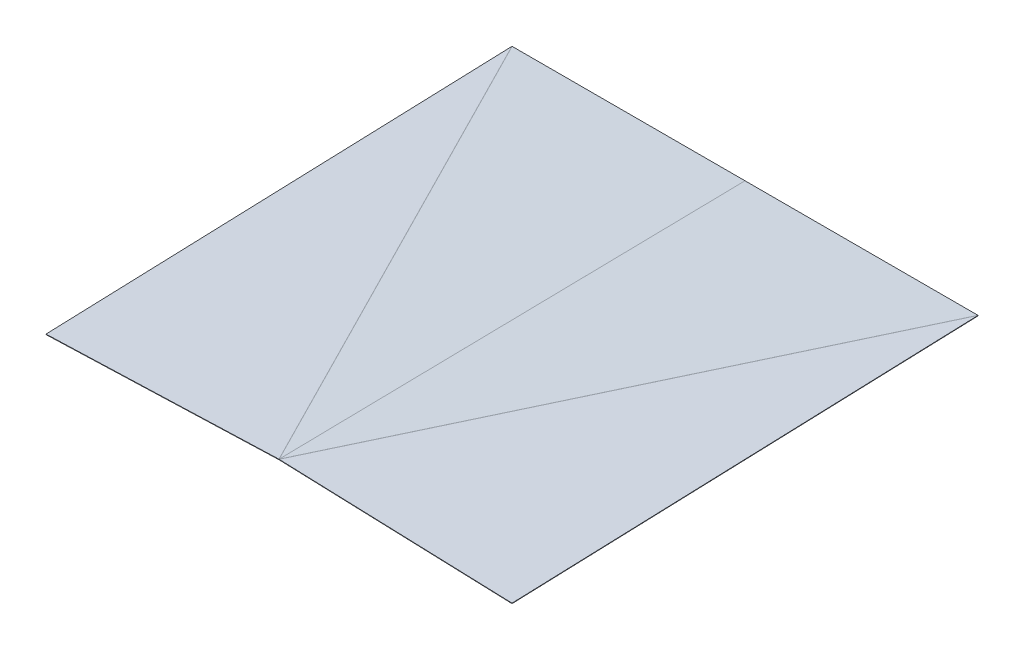
ISO-10303-21;
HEADER;
FILE_DESCRIPTION(('STEP AP214'),'2;1');
FILE_NAME('part.step','',(''),(''),'','','');
FILE_SCHEMA(('AUTOMOTIVE_DESIGN { 1 0 10303 214 1 1 1 1 }'));
ENDSEC;
DATA;
#1=APPLICATION_CONTEXT('core data for automotive mechanical design processes');
#2=APPLICATION_PROTOCOL_DEFINITION('international standard','automotive_design',2000,#1);
#3=PRODUCT_CONTEXT('',#1,'mechanical');
#4=PRODUCT('Part','Part','',(#3));
#5=PRODUCT_RELATED_PRODUCT_CATEGORY('part','',(#4));
#6=PRODUCT_DEFINITION_FORMATION('','',#4);
#7=PRODUCT_DEFINITION_CONTEXT('part definition',#1,'design');
#8=PRODUCT_DEFINITION('design','',#6,#7);
#9=PRODUCT_DEFINITION_SHAPE('','',#8);
#10=(LENGTH_UNIT() NAMED_UNIT(*) SI_UNIT(.MILLI.,.METRE.));
#11=(NAMED_UNIT(*) PLANE_ANGLE_UNIT() SI_UNIT($,.RADIAN.));
#12=(NAMED_UNIT(*) SI_UNIT($,.STERADIAN.) SOLID_ANGLE_UNIT());
#13=UNCERTAINTY_MEASURE_WITH_UNIT(LENGTH_MEASURE(1.E-05),#10,'distance_accuracy_value','');
#14=(GEOMETRIC_REPRESENTATION_CONTEXT(3) GLOBAL_UNCERTAINTY_ASSIGNED_CONTEXT((#13)) GLOBAL_UNIT_ASSIGNED_CONTEXT((#10,
#11,#12)) REPRESENTATION_CONTEXT('',''));
#15=CARTESIAN_POINT('',(0.,0.,0.));
#16=DIRECTION('',(0.,0.,1.));
#17=DIRECTION('',(1.,0.,0.));
#18=AXIS2_PLACEMENT_3D('',#15,#16,#17);
#19=CARTESIAN_POINT('',(0.,26.1825973923264,-1500.));
#20=DIRECTION('',(3.04601948530253E-06,0.0174524059057338,-0.99984769516103));
#21=DIRECTION('',(0.999999984769129,-0.000174532924306342,0.));
#22=AXIS2_PLACEMENT_3D('',#19,#20,#21);
#23=PLANE('',#22);
#24=DIRECTION('',(0.00017450634209741,0.999847679932479,0.0174524061715492));
#25=VECTOR('',#24,1.);
#26=CARTESIAN_POINT('',(749.783031723872,26.0517355652113,-1500.));
#27=LINE('',#26,#25);
#28=CARTESIAN_POINT('',(749.783031723872,26.0517355652113,-1500.));
#29=VERTEX_POINT('',#28);
#30=CARTESIAN_POINT('',(749.783293483385,27.55150708511,-1499.97382139074));
#31=VERTEX_POINT('',#30);
#32=EDGE_CURVE('E11',#29,#31,#27,.T.);
#33=ORIENTED_EDGE('',*,*,#32,.F.);
#34=DIRECTION('',(0.999999984769129,-0.000174532924306342,0.));
#35=VECTOR('',#34,1.);
#36=CARTESIAN_POINT('',(0.,26.1825973923264,-1500.));
#37=LINE('',#36,#35);
#38=CARTESIAN_POINT('',(0.00174506341600313,26.1825970877554,-1500.));
#39=VERTEX_POINT('',#38);
#40=EDGE_CURVE('E273',#39,#29,#37,.T.);
#41=ORIENTED_EDGE('',*,*,#40,.F.);
#42=DIRECTION('',(0.00017450634209741,0.999847679932478,0.0174524061715697));
#43=VECTOR('',#42,1.);
#44=CARTESIAN_POINT('',(0.00174506341600313,26.1825970877554,-1500.));
#45=LINE('',#44,#43);
#46=CARTESIAN_POINT('',(0.00200682292914925,27.6823686076542,-1499.97382139074));
#47=VERTEX_POINT('',#46);
#48=EDGE_CURVE('E54',#39,#47,#45,.T.);
#49=ORIENTED_EDGE('',*,*,#48,.T.);
#50=DIRECTION('',(0.999999984769129,-0.000174532924306342,0.));
#51=VECTOR('',#50,1.);
#52=CARTESIAN_POINT('',(0.000261759513146116,27.6823689122252,-1499.97382139074));
#53=LINE('',#52,#51);
#54=EDGE_CURVE('E208',#47,#31,#53,.T.);
#55=ORIENTED_EDGE('',*,*,#54,.T.);
#56=EDGE_LOOP('',(#33,#41,#49,#55));
#57=FACE_BOUND('',#56,.T.);
#58=ADVANCED_FACE('F41',(#57),#23,.T.);
#59=CARTESIAN_POINT('',(-4.97096941732543E-12,27.6823687827755,-1499.97382139034));
#60=CARTESIAN_POINT('',(-4.97096944158867E-12,27.1824449351973,-1499.98254759356));
#61=CARTESIAN_POINT('',(-4.97096946585192E-12,26.6825210876191,-1499.99127379678));
#62=CARTESIAN_POINT('',(-4.97096949011516E-12,26.1825972400409,-1500.));
#63=CARTESIAN_POINT('',(-23.000000000005,27.6823687827755,-1499.97382139034));
#64=CARTESIAN_POINT('',(-22.000000000005,27.1824449351973,-1499.98254759356));
#65=CARTESIAN_POINT('',(-21.000000000005,26.6825210876191,-1499.99127379678));
#66=CARTESIAN_POINT('',(-20.000000000005,26.1825972400409,-1500.));
#67=CARTESIAN_POINT('',(-23.000000000005,4.67977913642818,-1500.02617860966));
#68=CARTESIAN_POINT('',(-22.000000000005,5.17970298400638,-1500.01745240644));
#69=CARTESIAN_POINT('',(-21.000000000005,5.67962683158458,-1500.00872620322));
#70=CARTESIAN_POINT('',(-20.000000000005,6.17955067916277,-1500.));
#71=CARTESIAN_POINT('',(-4.96956218991128E-12,4.67977913642819,-1500.02617860966));
#72=CARTESIAN_POINT('',(-4.969623397988E-12,5.17970298400638,-1500.01745240644));
#73=CARTESIAN_POINT('',(-4.96968460606471E-12,5.67962683158458,-1500.00872620322));
#74=CARTESIAN_POINT('',(-4.96974581414143E-12,6.17955067916277,-1500.));
#75=CARTESIAN_POINT('',(22.999999999995,4.67977913642819,-1500.02617860966));
#76=CARTESIAN_POINT('',(21.999999999995,5.17970298400639,-1500.01745240644));
#77=CARTESIAN_POINT('',(20.999999999995,5.67962683158458,-1500.00872620322));
#78=CARTESIAN_POINT('',(19.999999999995,6.17955067916278,-1500.));
#79=CARTESIAN_POINT('',(22.999999999995,27.6823687827755,-1499.97382139034));
#80=CARTESIAN_POINT('',(21.999999999995,27.1824449351973,-1499.98254759356));
#81=CARTESIAN_POINT('',(20.999999999995,26.6825210876191,-1499.99127379678));
#82=CARTESIAN_POINT('',(19.999999999995,26.1825972400409,-1500.));
#83=CARTESIAN_POINT('',(-4.97096941732543E-12,27.6823687827755,-1499.97382139034));
#84=CARTESIAN_POINT('',(-4.97096944158867E-12,27.1824449351973,-1499.98254759356));
#85=CARTESIAN_POINT('',(-4.97096946585192E-12,26.6825210876191,-1499.99127379678));
#86=CARTESIAN_POINT('',(-4.97096949011516E-12,26.1825972400409,-1500.));
#87=(BOUNDED_SURFACE() B_SPLINE_SURFACE(3,3,((#59,#60,#61,#62),(#63,#64,#65,#66),(#67,#68,#69,
#70),(#71,#72,#73,#74),(#75,#76,#77,#78),(#79,#80,#81,#82),(#83,#84,#85,#86)),.UNSPECIFIED.,.T.,
.F.,.F.) B_SPLINE_SURFACE_WITH_KNOTS((4,3,4),(4,4),(0.,0.5,1.),(0.,1.),
.UNSPECIFIED.) GEOMETRIC_REPRESENTATION_ITEM() RATIONAL_B_SPLINE_SURFACE(((1.,1.,1.,1.),
(0.333333333333333,0.333333333333333,0.333333333333333,0.333333333333333),(0.333333333333333,
0.333333333333333,0.333333333333333,0.333333333333333),(1.,1.,1.,1.),(0.333333333333333,
0.333333333333333,0.333333333333333,0.333333333333333),(0.333333333333333,0.333333333333333,
0.333333333333333,0.333333333333333),(1.,1.,1.,1.))) REPRESENTATION_ITEM('') SURFACE());
#88=CARTESIAN_POINT('',(-4.97096997552787E-12,16.1810739596019,-1500.));
#89=DIRECTION('',(0.,0.,-1.));
#90=DIRECTION('',(0.,1.,0.));
#91=AXIS2_PLACEMENT_3D('',#88,#89,#90);
#92=ELLIPSE('',#91,10.0015232804391,10.);
#93=CARTESIAN_POINT('',(-0.00174506342609515,26.1825970877554,-1500.));
#94=VERTEX_POINT('',#93);
#95=EDGE_CURVE('E339',#39,#94,#92,.F.);
#96=DIRECTION('',(-0.00017450634209741,0.999847679932478,0.0174524061715492));
#97=VECTOR('',#96,1.);
#98=CARTESIAN_POINT('',(-0.00174506342609515,26.1825970877554,-1500.));
#99=LINE('',#98,#97);
#100=CARTESIAN_POINT('',(-0.00200682293926641,27.6823686076542,-1499.97382139074));
#101=VERTEX_POINT('',#100);
#102=EDGE_CURVE('E392',#94,#101,#99,.T.);
#103=CARTESIAN_POINT('',(-4.97096997552787E-12,16.1810739596019,-1500.));
#104=DIRECTION('',(0.,0.00227613866483323,-0.999997409593034));
#105=DIRECTION('',(0.,0.999997409593034,0.00227613866483323));
#106=AXIS2_PLACEMENT_3D('',#103,#104,#105);
#107=ELLIPSE('',#106,11.5013246162851,11.5);
#108=EDGE_CURVE('E235',#47,#101,#107,.F.);
#109=ORIENTED_EDGE('',*,*,#48,.F.);
#110=ORIENTED_EDGE('',*,*,#95,.T.);
#111=ORIENTED_EDGE('',*,*,#102,.T.);
#112=ORIENTED_EDGE('',*,*,#108,.F.);
#113=EDGE_LOOP('',(#109,#110,#111,#112));
#114=FACE_BOUND('',#113,.T.);
#115=ADVANCED_FACE('F411',(#114),#87,.F.);
#116=CARTESIAN_POINT('',(-750.,26.051697697103,-1500.));
#117=DIRECTION('',(-3.04601948530253E-06,0.0174524059057338,-0.99984769516103));
#118=DIRECTION('',(0.999999984769129,0.000174532924306342,0.));
#119=AXIS2_PLACEMENT_3D('',#116,#117,#118);
#120=PLANE('',#119);
#121=ORIENTED_EDGE('',*,*,#102,.F.);
#122=DIRECTION('',(0.999999984769129,0.000174532924306342,0.));
#123=VECTOR('',#122,1.);
#124=CARTESIAN_POINT('',(-750.,26.051697697103,-1500.));
#125=LINE('',#124,#123);
#126=CARTESIAN_POINT('',(-749.783031723872,26.0517355652113,-1500.));
#127=VERTEX_POINT('',#126);
#128=EDGE_CURVE('E281',#127,#94,#125,.T.);
#129=ORIENTED_EDGE('',*,*,#128,.F.);
#130=DIRECTION('',(-0.000174506342076608,0.999847679932478,0.0174524061715697));
#131=VECTOR('',#130,1.);
#132=CARTESIAN_POINT('',(-749.783031723872,26.0517355652113,-1500.));
#133=LINE('',#132,#131);
#134=CARTESIAN_POINT('',(-749.783293483385,27.55150708511,-1499.97382139074));
#135=VERTEX_POINT('',#134);
#136=EDGE_CURVE('E62',#127,#135,#133,.T.);
#137=ORIENTED_EDGE('',*,*,#136,.T.);
#138=DIRECTION('',(0.999999984769129,0.000174532924306342,0.));
#139=VECTOR('',#138,1.);
#140=CARTESIAN_POINT('',(-750.000261759513,27.5514692170017,-1499.97382139074));
#141=LINE('',#140,#139);
#142=EDGE_CURVE('E214',#135,#101,#141,.T.);
#143=ORIENTED_EDGE('',*,*,#142,.T.);
#144=EDGE_LOOP('',(#121,#129,#137,#143));
#145=FACE_BOUND('',#144,.T.);
#146=ADVANCED_FACE('F470',(#145),#120,.T.);
#147=CARTESIAN_POINT('',(-173.83730322874,-13.9475840839653,-348.638158916869));
#148=CARTESIAN_POINT('',(-173.833743905642,-14.4474619585485,-348.648620356601));
#149=CARTESIAN_POINT('',(-173.830184582543,-14.9473398331317,-348.659081796333));
#150=CARTESIAN_POINT('',(-173.826625259445,-15.4472177077149,-348.669543236065));
#151=CARTESIAN_POINT('',(-155.948786513254,-13.6331398838134,-357.576956071116));
#152=CARTESIAN_POINT('',(-155.050801354381,-14.117295548389,-358.03435736856));
#153=CARTESIAN_POINT('',(-154.152816195509,-14.6014512129646,-358.491758666004));
#154=CARTESIAN_POINT('',(-153.254831036636,-15.0856068775402,-358.949159963448));
#155=CARTESIAN_POINT('',(-731.972634035824,26.3655618803218,-1508.9214476791));
#156=CARTESIAN_POINT('',(-731.081767523148,26.8811619649126,-1509.35792609709));
#157=CARTESIAN_POINT('',(-730.190901010472,27.3967620495034,-1509.79440451507));
#158=CARTESIAN_POINT('',(-729.300034497796,27.9123621340942,-1510.23088293305));
#159=CARTESIAN_POINT('',(-749.86115075131,26.0511176801699,-1499.98265052486));
#160=CARTESIAN_POINT('',(-749.864710074408,26.5509955547531,-1499.97218908513));
#161=CARTESIAN_POINT('',(-749.868269397507,27.0508734293363,-1499.96172764539));
#162=CARTESIAN_POINT('',(-749.871828720605,27.5507513039195,-1499.95126620566));
#163=CARTESIAN_POINT('',(-767.749667466796,25.736673480018,-1491.04385337061));
#164=CARTESIAN_POINT('',(-768.647652625669,26.2208291445936,-1490.58645207317));
#165=CARTESIAN_POINT('',(-769.545637784542,26.7049848091692,-1490.12905077572));
#166=CARTESIAN_POINT('',(-770.443622943414,27.1891404737448,-1489.67164947828));
#167=CARTESIAN_POINT('',(-191.725819944226,-14.2620282841173,-339.699361762623));
#168=CARTESIAN_POINT('',(-192.616686456902,-14.7776283687081,-339.262883344643));
#169=CARTESIAN_POINT('',(-193.507552969578,-15.2932284532989,-338.826404926662));
#170=CARTESIAN_POINT('',(-194.398419482254,-15.8088285378897,-338.389926508682));
#171=CARTESIAN_POINT('',(-173.83730322874,-13.9475840839653,-348.638158916869));
#172=CARTESIAN_POINT('',(-173.833743905642,-14.4474619585485,-348.648620356601));
#173=CARTESIAN_POINT('',(-173.830184582543,-14.9473398331317,-348.659081796333));
#174=CARTESIAN_POINT('',(-173.826625259445,-15.4472177077149,-348.669543236065));
#175=(BOUNDED_SURFACE() B_SPLINE_SURFACE(3,3,((#147,#148,#149,#150),(#151,#152,#153,#154),(#155,
#156,#157,#158),(#159,#160,#161,#162),(#163,#164,#165,#166),(#167,#168,#169,#170),(#171,#172,
#173,#174)),.UNSPECIFIED.,.T.,.F.,.F.) B_SPLINE_SURFACE_WITH_KNOTS((4,3,4),(4,4),(0.,0.5,1.),
(0.,1.),.UNSPECIFIED.) GEOMETRIC_REPRESENTATION_ITEM() RATIONAL_B_SPLINE_SURFACE(((1.,1.,1.,1.),
(0.333333333333333,0.333333333333333,0.333333333333333,0.333333333333333),(0.333333333333333,
0.333333333333333,0.333333333333333,0.333333333333333),(1.,1.,1.,1.),(0.333333333333333,
0.333333333333333,0.333333333333333,0.333333333333333),(0.333333333333333,0.333333333333333,
0.333333333333333,0.333333333333333),(1.,1.,1.,1.))) REPRESENTATION_ITEM('') SURFACE());
#176=CARTESIAN_POINT('',(-461.849226990025,6.05176679810228,-924.310404720864));
#177=DIRECTION('',(-0.00017442716609027,0.99939403483228,0.0348070785447252));
#178=DIRECTION('',(0.447216271925113,-0.0310543918654342,0.893886587253255));
#179=AXIS2_PLACEMENT_3D('',#176,#177,#178);
#180=ELLIPSE('',#179,644.010385671997,10.);
#181=CARTESIAN_POINT('',(-750.,26.0366005234634,-1499.56652422699));
#182=VERTEX_POINT('',#181);
#183=EDGE_CURVE('E352',#127,#182,#180,.T.);
#184=DIRECTION('',(-0.034878375087267,0.998785983095707,0.0347859012074423));
#185=VECTOR('',#184,1.);
#186=CARTESIAN_POINT('',(-750.,26.0366005234634,-1499.56652422699));
#187=LINE('',#186,#185);
#188=CARTESIAN_POINT('',(-750.052317562631,27.5347794981069,-1499.51434537518));
#189=VERTEX_POINT('',#188);
#190=EDGE_CURVE('E132',#182,#189,#187,.T.);
#191=CARTESIAN_POINT('',(-461.849226990025,6.05176679810228,-924.310404720864));
#192=DIRECTION('',(0.000867043243752945,0.999319005895459,0.0368886526200803));
#193=DIRECTION('',(0.447215465447525,-0.0333816801342968,0.893803105217231));
#194=AXIS2_PLACEMENT_3D('',#191,#192,#193);
#195=ELLIPSE('',#194,644.035423601369,11.5);
#196=EDGE_CURVE('E243',#135,#189,#195,.T.);
#197=ORIENTED_EDGE('',*,*,#136,.F.);
#198=ORIENTED_EDGE('',*,*,#183,.T.);
#199=ORIENTED_EDGE('',*,*,#190,.T.);
#200=ORIENTED_EDGE('',*,*,#196,.F.);
#201=EDGE_LOOP('',(#197,#198,#199,#200));
#202=FACE_BOUND('',#201,.T.);
#203=ADVANCED_FACE('F501',(#202),#175,.T.);
#204=CARTESIAN_POINT('',(-750.,26.051697697103,-1500.));
#205=DIRECTION('',(-0.999391564378683,-0.0348572405371204,-0.00121401435964298));
#206=DIRECTION('',(0.,-0.034807079074225,0.999394050035481));
#207=AXIS2_PLACEMENT_3D('',#204,#205,#206);
#208=PLANE('',#207);
#209=ORIENTED_EDGE('',*,*,#190,.F.);
#210=DIRECTION('',(0.,-0.034807079074225,0.999394050035481));
#211=VECTOR('',#210,1.);
#212=CARTESIAN_POINT('',(-750.,26.051697697103,-1500.));
#213=LINE('',#212,#211);
#214=CARTESIAN_POINT('',(-750.,-26.1905771188057,0.));
#215=VERTEX_POINT('',#214);
#216=EDGE_CURVE('E286',#182,#215,#213,.T.);
#217=ORIENTED_EDGE('',*,*,#216,.T.);
#218=DIRECTION('',(-0.034878375087267,0.998785983095707,0.0347859012074423));
#219=VECTOR('',#218,1.);
#220=CARTESIAN_POINT('',(-750.,-26.1905771188057,0.));
#221=LINE('',#220,#219);
#222=CARTESIAN_POINT('',(-750.052317562631,-24.6923981441621,0.0521788518111635));
#223=VERTEX_POINT('',#222);
#224=EDGE_CURVE('E141',#215,#223,#221,.T.);
#225=ORIENTED_EDGE('',*,*,#224,.T.);
#226=DIRECTION('',(0.,-0.034807079074225,0.999394050035481));
#227=VECTOR('',#226,1.);
#228=CARTESIAN_POINT('',(-750.052317562631,27.5498766717465,-1499.94782114819));
#229=LINE('',#228,#227);
#230=EDGE_CURVE('E254',#189,#223,#229,.T.);
#231=ORIENTED_EDGE('',*,*,#230,.F.);
#232=EDGE_LOOP('',(#209,#217,#225,#231));
#233=FACE_BOUND('',#232,.T.);
#234=ADVANCED_FACE('F506',(#233),#208,.T.);
#235=CARTESIAN_POINT('',(-750.,-26.1905771188057,0.));
#236=DIRECTION('',(0.00121401044448242,-0.0347647105763103,0.999394787397446));
#237=DIRECTION('',(0.999390827019096,0.0348994967024942,0.));
#238=AXIS2_PLACEMENT_3D('',#235,#236,#237);
#239=PLANE('',#238);
#240=ORIENTED_EDGE('',*,*,#224,.F.);
#241=DIRECTION('',(0.999390827019096,0.0348994967024942,0.));
#242=VECTOR('',#241,1.);
#243=CARTESIAN_POINT('',(-750.,-26.1905771188057,0.));
#244=LINE('',#243,#242);
#245=CARTESIAN_POINT('',(-0.499695413509548,-0.0174497483512402,0.));
#246=VERTEX_POINT('',#245);
#247=EDGE_CURVE('E285',#215,#246,#244,.T.);
#248=ORIENTED_EDGE('',*,*,#247,.T.);
#249=DIRECTION('',(-0.034878375087267,0.998785983095707,0.0347859012074423));
#250=VECTOR('',#249,1.);
#251=CARTESIAN_POINT('',(-0.499695413509548,-0.0174497483512402,0.));
#252=LINE('',#251,#250);
#253=CARTESIAN_POINT('',(-0.552012976140449,1.48072922629232,0.0521788518111635));
#254=VERTEX_POINT('',#253);
#255=EDGE_CURVE('E383',#246,#254,#252,.T.);
#256=ORIENTED_EDGE('',*,*,#255,.T.);
#257=DIRECTION('',(-0.999390827019096,-0.0348994967024942,0.));
#258=VECTOR('',#257,1.);
#259=CARTESIAN_POINT('',(-0.0523175626309008,1.49817897464357,0.0521788518111635));
#260=LINE('',#259,#258);
#261=EDGE_CURVE('E250',#223,#254,#260,.F.);
#262=ORIENTED_EDGE('',*,*,#261,.F.);
#263=EDGE_LOOP('',(#240,#248,#256,#262));
#264=FACE_BOUND('',#263,.T.);
#265=ADVANCED_FACE('F514',(#264),#239,.T.);
#266=CARTESIAN_POINT('',(0.,0.,0.));
#267=DIRECTION('',(-0.034878375087267,0.998785983095707,0.0347859012074423));
#268=DIRECTION('',(-0.999390827019096,-0.0348994967024942,0.));
#269=AXIS2_PLACEMENT_3D('',#266,#267,#268);
#270=CYLINDRICAL_SURFACE('',#269,0.5);
#271=ORIENTED_EDGE('',*,*,#255,.F.);
#272=CARTESIAN_POINT('',(0.,0.,0.));
#273=DIRECTION('',(-0.034878375087267,0.998785983095707,0.0347859012074423));
#274=DIRECTION('',(-0.999390827019096,-0.0348994967024942,0.));
#275=AXIS2_PLACEMENT_3D('',#272,#273,#274);
#276=CIRCLE('',#275,0.5);
#277=CARTESIAN_POINT('',(-0.379504881327545,-0.00191484504903678,-0.325533989649321));
#278=VERTEX_POINT('',#277);
#279=EDGE_CURVE('E277',#278,#246,#276,.T.);
#280=ORIENTED_EDGE('',*,*,#279,.F.);
#281=DIRECTION('',(-0.034878375087267,0.998785983095707,0.0347859012074423));
#282=VECTOR('',#281,1.);
#283=CARTESIAN_POINT('',(-0.379504881327545,-0.00191484504903678,-0.325533989649321));
#284=LINE('',#283,#282);
#285=CARTESIAN_POINT('',(-0.431822443958446,1.49626412959452,-0.273355137838157));
#286=VERTEX_POINT('',#285);
#287=EDGE_CURVE('E380',#278,#286,#284,.T.);
#288=ORIENTED_EDGE('',*,*,#287,.T.);
#289=CARTESIAN_POINT('',(-0.0523175626309008,1.49817897464357,0.0521788518111637));
#290=DIRECTION('',(-0.034878375087267,0.998785983095707,0.0347859012074423));
#291=DIRECTION('',(-0.999390827019096,-0.0348994967024942,0.));
#292=AXIS2_PLACEMENT_3D('',#289,#290,#291);
#293=CIRCLE('',#292,0.5);
#294=EDGE_CURVE('E203',#286,#254,#293,.T.);
#295=ORIENTED_EDGE('',*,*,#294,.T.);
#296=EDGE_LOOP('',(#271,#280,#288,#295));
#297=FACE_BOUND('',#296,.T.);
#298=ADVANCED_FACE('F517',(#297),#270,.F.);
#299=CARTESIAN_POINT('',(-0.173453334640116,-0.00907216852146533,0.0865691037255389));
#300=DIRECTION('',(-0.893773880674253,-0.0467472550031436,0.446075043433453));
#301=DIRECTION('',(0.4471596461844,-0.015532357232986,0.894319292368799));
#302=AXIS2_PLACEMENT_3D('',#299,#300,#301);
#303=PLANE('',#302);
#304=ORIENTED_EDGE('',*,*,#287,.F.);
#305=DIRECTION('',(0.4471596461844,-0.015532357232986,0.894319292368799));
#306=VECTOR('',#305,1.);
#307=CARTESIAN_POINT('',(-0.173453334640116,-0.00907216852146533,0.0865691037255389));
#308=LINE('',#307,#306);
#309=CARTESIAN_POINT('',(-0.835411701997753,0.01392135051116,-1.23734763098974));
#310=VERTEX_POINT('',#309);
#311=EDGE_CURVE('E298',#310,#278,#308,.T.);
#312=ORIENTED_EDGE('',*,*,#311,.F.);
#313=DIRECTION('',(-0.034878375087252,0.998785983095708,0.0347859012074348));
#314=VECTOR('',#313,1.);
#315=CARTESIAN_POINT('',(-0.835411701997753,0.01392135051116,-1.23734763098974));
#316=LINE('',#315,#314);
#317=CARTESIAN_POINT('',(-0.887729264628654,1.51210032515472,-1.18516877917857));
#318=VERTEX_POINT('',#317);
#319=EDGE_CURVE('E377',#310,#318,#316,.T.);
#320=ORIENTED_EDGE('',*,*,#319,.T.);
#321=DIRECTION('',(0.4471596461844,-0.015532357232986,0.894319292368799));
#322=VECTOR('',#321,1.);
#323=CARTESIAN_POINT('',(-0.225770897271016,1.48910680612209,0.138747955536702));
#324=LINE('',#323,#322);
#325=EDGE_CURVE('E202',#318,#286,#324,.T.);
#326=ORIENTED_EDGE('',*,*,#325,.T.);
#327=EDGE_LOOP('',(#304,#312,#320,#326));
#328=FACE_BOUND('',#327,.T.);
#329=ADVANCED_FACE('F521',(#328),#303,.F.);
#330=CARTESIAN_POINT('',(-0.48662795112521,-9.97393848044592,-1.58520664306404));
#331=DIRECTION('',(-0.447159646184399,0.0155323572329809,-0.894319292368799));
#332=DIRECTION('',(-0.894427190999916,0.,0.447213595499958));
#333=AXIS2_PLACEMENT_3D('',#330,#331,#332);
#334=PLANE('',#333);
#335=ORIENTED_EDGE('',*,*,#319,.F.);
#336=CARTESIAN_POINT('',(-0.48662795112521,-9.97393848044592,-1.58520664306404));
#337=DIRECTION('',(0.447159646184399,-0.0155323572329809,0.894319292368799));
#338=DIRECTION('',(0.894427190999916,0.,-0.447213595499958));
#339=AXIS2_PLACEMENT_3D('',#336,#337,#338);
#340=CIRCLE('',#339,10.);
#341=CARTESIAN_POINT('',(-0.488374759609465,0.0245383113857771,-1.41068216951868));
#342=VERTEX_POINT('',#341);
#343=EDGE_CURVE('E343',#310,#342,#340,.F.);
#344=ORIENTED_EDGE('',*,*,#343,.T.);
#345=DIRECTION('',(-0.00017450634209741,0.999847679932478,0.0174524061715492));
#346=VECTOR('',#345,1.);
#347=CARTESIAN_POINT('',(-0.488374759609465,0.0245383113857771,-1.41068216951868));
#348=LINE('',#347,#346);
#349=CARTESIAN_POINT('',(-0.488636753254472,1.52430982920069,-1.38450344323161));
#350=VERTEX_POINT('',#349);
#351=EDGE_CURVE('E374',#342,#350,#348,.T.);
#352=ORIENTED_EDGE('',*,*,#351,.T.);
#353=CARTESIAN_POINT('',(-0.486627951125233,-9.97393848044592,-1.58520664306408));
#354=DIRECTION('',(0.4471596461844,-0.015532357232986,0.894319292368799));
#355=DIRECTION('',(0.894427190999916,0.,-0.447213595499958));
#356=AXIS2_PLACEMENT_3D('',#353,#354,#355);
#357=CIRCLE('',#356,11.5);
#358=EDGE_CURVE('E239',#318,#350,#357,.F.);
#359=ORIENTED_EDGE('',*,*,#358,.F.);
#360=EDGE_LOOP('',(#335,#344,#352,#359));
#361=FACE_BOUND('',#360,.T.);
#362=ADVANCED_FACE('F525',(#361),#334,.F.);
#363=CARTESIAN_POINT('',(-0.341220743643984,0.0251701728555556,-1.44541009812566));
#364=DIRECTION('',(0.229723569280202,-0.0169455757174329,0.973108385114818));
#365=DIRECTION('',(-0.973255902250123,-0.00417904262300681,0.229685620660185));
#366=AXIS2_PLACEMENT_3D('',#363,#364,#365);
#367=PLANE('',#366);
#368=ORIENTED_EDGE('',*,*,#351,.F.);
#369=DIRECTION('',(-0.973255902250123,-0.00417904262300681,0.229685620660185));
#370=VECTOR('',#369,1.);
#371=CARTESIAN_POINT('',(-0.341220743643984,0.0251701728555556,-1.44541009812566));
#372=LINE('',#371,#370);
#373=CARTESIAN_POINT('',(-0.00174680848440324,0.0266278398858926,-1.52552539168408));
#374=VERTEX_POINT('',#373);
#375=EDGE_CURVE('E302',#374,#342,#372,.T.);
#376=ORIENTED_EDGE('',*,*,#375,.F.);
#377=DIRECTION('',(-0.000174680847943225,0.999847679902015,0.0174524061710175));
#378=VECTOR('',#377,1.);
#379=CARTESIAN_POINT('',(-0.00174680848440324,0.0266278398858926,-1.52552539168408));
#380=LINE('',#379,#378);
#381=CARTESIAN_POINT('',(-0.00200856799754936,1.52639935978461,-1.49934678242676));
#382=VERTEX_POINT('',#381);
#383=EDGE_CURVE('E371',#374,#382,#380,.T.);
#384=ORIENTED_EDGE('',*,*,#383,.T.);
#385=DIRECTION('',(-0.973255902250123,-0.00417904262300681,0.229685620660185));
#386=VECTOR('',#385,1.);
#387=CARTESIAN_POINT('',(-0.34148250315713,1.52494169275427,-1.41923148886834));
#388=LINE('',#387,#386);
#389=EDGE_CURVE('E231',#382,#350,#388,.T.);
#390=ORIENTED_EDGE('',*,*,#389,.T.);
#391=EDGE_LOOP('',(#368,#376,#384,#390));
#392=FACE_BOUND('',#391,.T.);
#393=ADVANCED_FACE('F529',(#392),#367,.T.);
#394=CARTESIAN_POINT('',(-4.97097124483063E-12,-9.97184895904473,-1.70004945853251));
#395=DIRECTION('',(1.24206532456251E-13,0.0174524069511086,-0.999847695147422));
#396=DIRECTION('',(0.,0.999847695147422,0.0174524069511086));
#397=AXIS2_PLACEMENT_3D('',#394,#395,#396);
#398=PLANE('',#397);
#399=ORIENTED_EDGE('',*,*,#383,.F.);
#400=CARTESIAN_POINT('',(-4.97097124483063E-12,-9.97184895904473,-1.70004945853251));
#401=DIRECTION('',(-1.24206532456251E-13,-0.0174524069511086,0.999847695147422));
#402=DIRECTION('',(0.,-0.999847695147422,-0.0174524069511086));
#403=AXIS2_PLACEMENT_3D('',#400,#401,#402);
#404=CIRCLE('',#403,10.);
#405=CARTESIAN_POINT('',(0.00174506342098219,0.0266278401903709,-1.52552539167877));
#406=VERTEX_POINT('',#405);
#407=EDGE_CURVE('E327',#374,#406,#404,.F.);
#408=ORIENTED_EDGE('',*,*,#407,.T.);
#409=DIRECTION('',(0.00017450634209741,0.999847679932479,0.0174524061715492));
#410=VECTOR('',#409,1.);
#411=CARTESIAN_POINT('',(0.00174506342098219,0.0266278401903709,-1.52552539167877));
#412=LINE('',#411,#410);
#413=CARTESIAN_POINT('',(0.00200682293487516,1.52639936008909,-1.49934678242144));
#414=VERTEX_POINT('',#413);
#415=EDGE_CURVE('E368',#406,#414,#412,.T.);
#416=ORIENTED_EDGE('',*,*,#415,.T.);
#417=CARTESIAN_POINT('',(-4.97097124483063E-12,-9.97184895904473,-1.70004945853251));
#418=DIRECTION('',(-1.24206532456251E-13,-0.0174524069511086,0.999847695147422));
#419=DIRECTION('',(0.,-0.999847695147422,-0.0174524069511086));
#420=AXIS2_PLACEMENT_3D('',#417,#418,#419);
#421=CIRCLE('',#420,11.5);
#422=EDGE_CURVE('E227',#382,#414,#421,.F.);
#423=ORIENTED_EDGE('',*,*,#422,.F.);
#424=EDGE_LOOP('',(#399,#408,#416,#423));
#425=FACE_BOUND('',#424,.T.);
#426=ADVANCED_FACE('F474',(#425),#398,.F.);
#427=CARTESIAN_POINT('',(0.341220743643984,0.0251701728555556,-1.44541009812566));
#428=DIRECTION('',(-0.229723569280202,-0.0169455757174329,0.973108385114818));
#429=DIRECTION('',(-0.973255902250123,0.00417904262300681,-0.229685620660185));
#430=AXIS2_PLACEMENT_3D('',#427,#428,#429);
#431=PLANE('',#430);
#432=ORIENTED_EDGE('',*,*,#415,.F.);
#433=DIRECTION('',(-0.973255902250123,0.00417904262300681,-0.229685620660185));
#434=VECTOR('',#433,1.);
#435=CARTESIAN_POINT('',(0.341220743643984,0.0251701728555556,-1.44541009812566));
#436=LINE('',#435,#434);
#437=CARTESIAN_POINT('',(0.488373014546043,0.0245383188788675,-1.41068258134867));
#438=VERTEX_POINT('',#437);
#439=EDGE_CURVE('E306',#438,#406,#436,.T.);
#440=ORIENTED_EDGE('',*,*,#439,.F.);
#441=DIRECTION('',(0.00017450634209299,0.999847679932478,0.017452406171547));
#442=VECTOR('',#441,1.);
#443=CARTESIAN_POINT('',(0.488373014546043,0.0245383188788675,-1.41068258134867));
#444=LINE('',#443,#442);
#445=CARTESIAN_POINT('',(0.488634774059189,1.52430983877759,-1.38450397209135));
#446=VERTEX_POINT('',#445);
#447=EDGE_CURVE('E365',#438,#446,#444,.T.);
#448=ORIENTED_EDGE('',*,*,#447,.T.);
#449=DIRECTION('',(-0.973255902250123,0.00417904262300681,-0.229685620660185));
#450=VECTOR('',#449,1.);
#451=CARTESIAN_POINT('',(0.34148250315713,1.52494169275427,-1.41923148886834));
#452=LINE('',#451,#450);
#453=EDGE_CURVE('E221',#446,#414,#452,.T.);
#454=ORIENTED_EDGE('',*,*,#453,.T.);
#455=EDGE_LOOP('',(#432,#440,#448,#454));
#456=FACE_BOUND('',#455,.T.);
#457=ADVANCED_FACE('F476',(#456),#431,.T.);
#458=CARTESIAN_POINT('',(0.486627951125237,-9.97393848044591,-1.58520664306439));
#459=DIRECTION('',(-0.4471596461844,-0.0155323572330138,0.894319292368798));
#460=DIRECTION('',(0.894427190999916,0.,0.447213595499958));
#461=AXIS2_PLACEMENT_3D('',#458,#459,#460);
#462=PLANE('',#461);
#463=ORIENTED_EDGE('',*,*,#447,.F.);
#464=CARTESIAN_POINT('',(0.486627951125237,-9.97393848044591,-1.58520664306439));
#465=DIRECTION('',(0.4471596461844,0.0155323572330138,-0.894319292368798));
#466=DIRECTION('',(-0.894427190999916,0.,-0.447213595499958));
#467=AXIS2_PLACEMENT_3D('',#464,#465,#466);
#468=CIRCLE('',#467,10.);
#469=CARTESIAN_POINT('',(0.835411701997754,0.013921350511153,-1.23734763098974));
#470=VERTEX_POINT('',#469);
#471=EDGE_CURVE('E323',#438,#470,#468,.T.);
#472=ORIENTED_EDGE('',*,*,#471,.T.);
#473=DIRECTION('',(0.034878375087267,0.998785983095707,0.0347859012074423));
#474=VECTOR('',#473,1.);
#475=CARTESIAN_POINT('',(0.835411701997754,0.013921350511153,-1.23734763098974));
#476=LINE('',#475,#474);
#477=CARTESIAN_POINT('',(0.88772926462865,1.51210032515471,-1.18516877917857));
#478=VERTEX_POINT('',#477);
#479=EDGE_CURVE('E362',#470,#478,#476,.T.);
#480=ORIENTED_EDGE('',*,*,#479,.T.);
#481=CARTESIAN_POINT('',(0.486627951125113,-9.97393848044592,-1.58520664306414));
#482=DIRECTION('',(0.4471596461844,0.015532357232986,-0.894319292368799));
#483=DIRECTION('',(-0.894427190999916,0.,-0.447213595499958));
#484=AXIS2_PLACEMENT_3D('',#481,#482,#483);
#485=CIRCLE('',#484,11.5);
#486=EDGE_CURVE('E222',#446,#478,#485,.T.);
#487=ORIENTED_EDGE('',*,*,#486,.F.);
#488=EDGE_LOOP('',(#463,#472,#480,#487));
#489=FACE_BOUND('',#488,.T.);
#490=ADVANCED_FACE('F477',(#489),#462,.T.);
#491=CARTESIAN_POINT('',(0.173453334640116,-0.00907216852147231,0.0865691037255391));
#492=DIRECTION('',(-0.893773880674253,0.0467472550031436,-0.446075043433453));
#493=DIRECTION('',(-0.4471596461844,-0.015532357232986,0.894319292368799));
#494=AXIS2_PLACEMENT_3D('',#491,#492,#493);
#495=PLANE('',#494);
#496=ORIENTED_EDGE('',*,*,#479,.F.);
#497=DIRECTION('',(-0.4471596461844,-0.015532357232986,0.894319292368799));
#498=VECTOR('',#497,1.);
#499=CARTESIAN_POINT('',(0.173453334640116,-0.00907216852147231,0.0865691037255391));
#500=LINE('',#499,#498);
#501=CARTESIAN_POINT('',(0.379504881327546,-0.00191484504904376,-0.32553398964932));
#502=VERTEX_POINT('',#501);
#503=EDGE_CURVE('E310',#470,#502,#500,.T.);
#504=ORIENTED_EDGE('',*,*,#503,.T.);
#505=DIRECTION('',(0.034878375087267,0.998785983095707,0.0347859012074423));
#506=VECTOR('',#505,1.);
#507=CARTESIAN_POINT('',(0.379504881327546,-0.00191484504904376,-0.32553398964932));
#508=LINE('',#507,#506);
#509=CARTESIAN_POINT('',(0.431822443958446,1.49626412959452,-0.273355137838156));
#510=VERTEX_POINT('',#509);
#511=EDGE_CURVE('E189',#502,#510,#508,.T.);
#512=ORIENTED_EDGE('',*,*,#511,.T.);
#513=DIRECTION('',(-0.4471596461844,-0.015532357232986,0.894319292368799));
#514=VECTOR('',#513,1.);
#515=CARTESIAN_POINT('',(0.225770897271017,1.48910680612209,0.138747955536703));
#516=LINE('',#515,#514);
#517=EDGE_CURVE('E200',#478,#510,#516,.T.);
#518=ORIENTED_EDGE('',*,*,#517,.F.);
#519=EDGE_LOOP('',(#496,#504,#512,#518));
#520=FACE_BOUND('',#519,.T.);
#521=ADVANCED_FACE('F449',(#520),#495,.T.);
#522=CARTESIAN_POINT('',(0.,0.,0.));
#523=DIRECTION('',(0.034878375087267,0.998785983095707,0.0347859012074423));
#524=DIRECTION('',(-0.999390827019096,0.0348994967024942,0.));
#525=AXIS2_PLACEMENT_3D('',#522,#523,#524);
#526=CYLINDRICAL_SURFACE('',#525,0.5);
#527=ORIENTED_EDGE('',*,*,#511,.F.);
#528=CARTESIAN_POINT('',(0.,0.,0.));
#529=DIRECTION('',(0.034878375087267,0.998785983095707,0.0347859012074423));
#530=DIRECTION('',(-0.999390827019096,0.0348994967024942,0.));
#531=AXIS2_PLACEMENT_3D('',#528,#529,#530);
#532=CIRCLE('',#531,0.5);
#533=CARTESIAN_POINT('',(0.499695413509548,-0.0174497483512471,0.));
#534=VERTEX_POINT('',#533);
#535=EDGE_CURVE('E183',#534,#502,#532,.T.);
#536=ORIENTED_EDGE('',*,*,#535,.F.);
#537=DIRECTION('',(0.034878375087267,0.998785983095707,0.0347859012074423));
#538=VECTOR('',#537,1.);
#539=CARTESIAN_POINT('',(0.499695413509548,-0.0174497483512471,0.));
#540=LINE('',#539,#538);
#541=CARTESIAN_POINT('',(0.552012976140449,1.48072922629231,0.0521788518111634));
#542=VERTEX_POINT('',#541);
#543=EDGE_CURVE('E177',#534,#542,#540,.T.);
#544=ORIENTED_EDGE('',*,*,#543,.T.);
#545=CARTESIAN_POINT('',(0.0523175626309006,1.49817897464356,0.0521788518111634));
#546=DIRECTION('',(0.034878375087267,0.998785983095707,0.0347859012074423));
#547=DIRECTION('',(-0.999390827019096,0.0348994967024942,0.));
#548=AXIS2_PLACEMENT_3D('',#545,#546,#547);
#549=CIRCLE('',#548,0.5);
#550=EDGE_CURVE('E180',#542,#510,#549,.T.);
#551=ORIENTED_EDGE('',*,*,#550,.T.);
#552=EDGE_LOOP('',(#527,#536,#544,#551));
#553=FACE_BOUND('',#552,.T.);
#554=ADVANCED_FACE('F179',(#553),#526,.F.);
#555=CARTESIAN_POINT('',(0.,0.,0.));
#556=DIRECTION('',(-0.00121401044448242,-0.0347647105763103,0.999394787397446));
#557=DIRECTION('',(0.999390827019096,-0.0348994967024942,0.));
#558=AXIS2_PLACEMENT_3D('',#555,#556,#557);
#559=PLANE('',#558);
#560=ORIENTED_EDGE('',*,*,#543,.F.);
#561=DIRECTION('',(0.999390827019096,-0.0348994967024942,0.));
#562=VECTOR('',#561,1.);
#563=CARTESIAN_POINT('',(0.,0.,0.));
#564=LINE('',#563,#562);
#565=CARTESIAN_POINT('',(750.,-26.1905771188057,0.));
#566=VERTEX_POINT('',#565);
#567=EDGE_CURVE('E269',#534,#566,#564,.T.);
#568=ORIENTED_EDGE('',*,*,#567,.T.);
#569=DIRECTION('',(0.034878375087267,0.998785983095707,0.0347859012074423));
#570=VECTOR('',#569,1.);
#571=CARTESIAN_POINT('',(750.,-26.1905771188057,0.));
#572=LINE('',#571,#570);
#573=CARTESIAN_POINT('',(750.052317562631,-24.6923981441621,0.0521788518111634));
#574=VERTEX_POINT('',#573);
#575=EDGE_CURVE('E190',#566,#574,#572,.T.);
#576=ORIENTED_EDGE('',*,*,#575,.T.);
#577=DIRECTION('',(-0.999390827019096,0.0348994967024942,0.));
#578=VECTOR('',#577,1.);
#579=CARTESIAN_POINT('',(0.0523175626309006,1.49817897464356,0.0521788518111634));
#580=LINE('',#579,#578);
#581=EDGE_CURVE('E196',#542,#574,#580,.F.);
#582=ORIENTED_EDGE('',*,*,#581,.F.);
#583=EDGE_LOOP('',(#560,#568,#576,#582));
#584=FACE_BOUND('',#583,.T.);
#585=ADVANCED_FACE('F205',(#584),#559,.T.);
#586=CARTESIAN_POINT('',(750.,-26.1905771188057,0.));
#587=DIRECTION('',(0.999391564378683,-0.0348572405371204,-0.00121401435964291));
#588=DIRECTION('',(0.,0.034807079074225,-0.999394050035481));
#589=AXIS2_PLACEMENT_3D('',#586,#587,#588);
#590=PLANE('',#589);
#591=ORIENTED_EDGE('',*,*,#575,.F.);
#592=DIRECTION('',(0.,0.034807079074225,-0.999394050035481));
#593=VECTOR('',#592,1.);
#594=CARTESIAN_POINT('',(750.,-26.1905771188057,0.));
#595=LINE('',#594,#593);
#596=CARTESIAN_POINT('',(750.,26.0366005234634,-1499.56652422699));
#597=VERTEX_POINT('',#596);
#598=EDGE_CURVE('E272',#566,#597,#595,.T.);
#599=ORIENTED_EDGE('',*,*,#598,.T.);
#600=DIRECTION('',(0.0348783750872772,0.998785983095707,0.0347859012074458));
#601=VECTOR('',#600,1.);
#602=CARTESIAN_POINT('',(750.,26.0366005234634,-1499.56652422699));
#603=LINE('',#602,#601);
#604=CARTESIAN_POINT('',(750.052317562631,27.5347794981069,-1499.51434537518));
#605=VERTEX_POINT('',#604);
#606=EDGE_CURVE('E47',#597,#605,#603,.T.);
#607=ORIENTED_EDGE('',*,*,#606,.T.);
#608=DIRECTION('',(0.,0.034807079074225,-0.999394050035481));
#609=VECTOR('',#608,1.);
#610=CARTESIAN_POINT('',(750.052317562631,-24.6923981441621,0.0521788518111634));
#611=LINE('',#610,#609);
#612=EDGE_CURVE('E207',#574,#605,#611,.T.);
#613=ORIENTED_EDGE('',*,*,#612,.F.);
#614=EDGE_LOOP('',(#591,#599,#607,#613));
#615=FACE_BOUND('',#614,.T.);
#616=ADVANCED_FACE('F436',(#615),#590,.T.);
#617=CARTESIAN_POINT('',(749.86115075131,26.0511176801699,-1499.98265052486));
#618=CARTESIAN_POINT('',(749.864710074409,26.5509955547531,-1499.97218908513));
#619=CARTESIAN_POINT('',(749.868269397507,27.0508734293363,-1499.96172764539));
#620=CARTESIAN_POINT('',(749.871828720606,27.5507513039195,-1499.95126620566));
#621=CARTESIAN_POINT('',(731.972634035824,26.3655618803219,-1508.92144767911));
#622=CARTESIAN_POINT('',(731.081767523149,26.8811619649127,-1509.35792609709));
#623=CARTESIAN_POINT('',(730.190901010473,27.3967620495035,-1509.79440451507));
#624=CARTESIAN_POINT('',(729.300034497797,27.9123621340943,-1510.23088293305));
#625=CARTESIAN_POINT('',(155.948786513254,-13.6331398838134,-357.576956071116));
#626=CARTESIAN_POINT('',(155.050801354382,-14.117295548389,-358.034357368561));
#627=CARTESIAN_POINT('',(154.152816195509,-14.6014512129646,-358.491758666005));
#628=CARTESIAN_POINT('',(153.254831036636,-15.0856068775402,-358.949159963449));
#629=CARTESIAN_POINT('',(173.83730322874,-13.9475840839653,-348.63815891687));
#630=CARTESIAN_POINT('',(173.833743905642,-14.4474619585485,-348.648620356602));
#631=CARTESIAN_POINT('',(173.830184582543,-14.9473398331317,-348.659081796334));
#632=CARTESIAN_POINT('',(173.826625259445,-15.4472177077149,-348.669543236066));
#633=CARTESIAN_POINT('',(191.725819944226,-14.2620282841173,-339.699361762623));
#634=CARTESIAN_POINT('',(192.616686456902,-14.7776283687081,-339.262883344643));
#635=CARTESIAN_POINT('',(193.507552969578,-15.2932284532989,-338.826404926663));
#636=CARTESIAN_POINT('',(194.398419482254,-15.8088285378897,-338.389926508682));
#637=CARTESIAN_POINT('',(767.749667466796,25.736673480018,-1491.04385337061));
#638=CARTESIAN_POINT('',(768.647652625669,26.2208291445936,-1490.58645207317));
#639=CARTESIAN_POINT('',(769.545637784542,26.7049848091692,-1490.12905077572));
#640=CARTESIAN_POINT('',(770.443622943415,27.1891404737448,-1489.67164947828));
#641=CARTESIAN_POINT('',(749.86115075131,26.0511176801699,-1499.98265052486));
#642=CARTESIAN_POINT('',(749.864710074409,26.5509955547531,-1499.97218908513));
#643=CARTESIAN_POINT('',(749.868269397507,27.0508734293363,-1499.96172764539));
#644=CARTESIAN_POINT('',(749.871828720606,27.5507513039195,-1499.95126620566));
#645=(BOUNDED_SURFACE() B_SPLINE_SURFACE(3,3,((#617,#618,#619,#620),(#621,#622,#623,#624),(#625,
#626,#627,#628),(#629,#630,#631,#632),(#633,#634,#635,#636),(#637,#638,#639,#640),(#641,#642,
#643,#644)),.UNSPECIFIED.,.T.,.F.,.F.) B_SPLINE_SURFACE_WITH_KNOTS((4,3,4),(4,4),(0.,0.5,1.),
(0.,1.),.UNSPECIFIED.) GEOMETRIC_REPRESENTATION_ITEM() RATIONAL_B_SPLINE_SURFACE(((1.,1.,1.,1.),
(0.333333333333333,0.333333333333333,0.333333333333333,0.333333333333333),(0.333333333333333,
0.333333333333333,0.333333333333333,0.333333333333333),(1.,1.,1.,1.),(0.333333333333333,
0.333333333333333,0.333333333333333,0.333333333333333),(0.333333333333333,0.333333333333333,
0.333333333333333,0.333333333333333),(1.,1.,1.,1.))) REPRESENTATION_ITEM('') SURFACE());
#646=CARTESIAN_POINT('',(461.849226990025,6.0517667981023,-924.310404720864));
#647=DIRECTION('',(0.00017442716609027,0.99939403483228,0.0348070785447252));
#648=DIRECTION('',(0.447216271925113,0.0310543918654342,-0.893886587253255));
#649=AXIS2_PLACEMENT_3D('',#646,#647,#648);
#650=ELLIPSE('',#649,644.010385671998,10.);
#651=EDGE_CURVE('E289',#597,#29,#650,.T.);
#652=CARTESIAN_POINT('',(461.849226990025,6.0517667981023,-924.310404720864));
#653=DIRECTION('',(-0.000867043243752943,0.999319005895459,0.0368886526200803));
#654=DIRECTION('',(0.447215465447525,0.0333816801342968,-0.893803105217231));
#655=AXIS2_PLACEMENT_3D('',#652,#653,#654);
#656=ELLIPSE('',#655,644.035423601369,11.5);
#657=EDGE_CURVE('E226',#605,#31,#656,.T.);
#658=ORIENTED_EDGE('',*,*,#651,.T.);
#659=ORIENTED_EDGE('',*,*,#32,.T.);
#660=ORIENTED_EDGE('',*,*,#657,.F.);
#661=ORIENTED_EDGE('',*,*,#606,.F.);
#662=EDGE_LOOP('',(#658,#659,#660,#661));
#663=FACE_BOUND('',#662,.T.);
#664=ADVANCED_FACE('F43',(#663),#645,.T.);
#665=CARTESIAN_POINT('',(0.0523175626309006,1.49817897464356,0.0521788518111634));
#666=DIRECTION('',(0.034878375087267,0.998785983095707,0.0347859012074423));
#667=DIRECTION('',(-0.999390827019096,0.0348994967024942,0.));
#668=AXIS2_PLACEMENT_3D('',#665,#666,#667);
#669=PLANE('',#668);
#670=ORIENTED_EDGE('',*,*,#612,.T.);
#671=DIRECTION('',(0.4471596461844,0.015532357232986,-0.894319292368799));
#672=VECTOR('',#671,1.);
#673=CARTESIAN_POINT('',(0.225770897271013,1.48910680612209,0.1387479555367));
#674=LINE('',#673,#672);
#675=EDGE_CURVE('E220',#605,#478,#674,.F.);
#676=ORIENTED_EDGE('',*,*,#675,.T.);
#677=ORIENTED_EDGE('',*,*,#517,.T.);
#678=ORIENTED_EDGE('',*,*,#550,.F.);
#679=ORIENTED_EDGE('',*,*,#581,.T.);
#680=EDGE_LOOP('',(#670,#676,#677,#678,#679));
#681=FACE_BOUND('',#680,.T.);
#682=ADVANCED_FACE('F195',(#681),#669,.T.);
#683=CARTESIAN_POINT('',(0.000261759513146116,1.49977151989872,0.0261786092573238));
#684=DIRECTION('',(-0.00017450634209741,-0.999847679932479,-0.0174524061715492));
#685=DIRECTION('',(0.,0.0174524064372836,-0.999847695156391));
#686=AXIS2_PLACEMENT_3D('',#683,#684,#685);
#687=PLANE('',#686);
#688=ORIENTED_EDGE('',*,*,#54,.F.);
#689=DIRECTION('',(0.,0.0174524064372836,-0.999847695156391));
#690=VECTOR('',#689,1.);
#691=CARTESIAN_POINT('',(0.00200682292914925,1.49977121542046,0.026178603942636));
#692=LINE('',#691,#690);
#693=EDGE_CURVE('E408',#47,#414,#692,.F.);
#694=ORIENTED_EDGE('',*,*,#693,.T.);
#695=ORIENTED_EDGE('',*,*,#453,.F.);
#696=DIRECTION('',(0.4471596461844,0.015532357232986,-0.894319292368799));
#697=VECTOR('',#696,1.);
#698=CARTESIAN_POINT('',(-0.173323593298397,1.50131631974496,-0.06058723737605));
#699=LINE('',#698,#697);
#700=EDGE_CURVE('E410',#446,#31,#699,.T.);
#701=ORIENTED_EDGE('',*,*,#700,.T.);
#702=EDGE_LOOP('',(#688,#694,#695,#701));
#703=FACE_BOUND('',#702,.T.);
#704=ADVANCED_FACE('F405',(#703),#687,.F.);
#705=CARTESIAN_POINT('',(-0.000261759513146116,1.49977151989872,0.0261786092573238));
#706=DIRECTION('',(0.00017450634209741,-0.999847679932478,-0.0174524061715492));
#707=DIRECTION('',(0.,0.0174524064372836,-0.999847695156391));
#708=AXIS2_PLACEMENT_3D('',#705,#706,#707);
#709=PLANE('',#708);
#710=ORIENTED_EDGE('',*,*,#142,.F.);
#711=DIRECTION('',(-0.4471596461844,0.015532357232986,-0.894319292368799));
#712=VECTOR('',#711,1.);
#713=CARTESIAN_POINT('',(-0.488634774059354,1.52430983877759,-1.38450397209127));
#714=LINE('',#713,#712);
#715=EDGE_CURVE('E423',#135,#350,#714,.F.);
#716=ORIENTED_EDGE('',*,*,#715,.T.);
#717=ORIENTED_EDGE('',*,*,#389,.F.);
#718=DIRECTION('',(0.,0.0174524064372836,-0.999847695156391));
#719=VECTOR('',#718,1.);
#720=CARTESIAN_POINT('',(-0.00200856799754936,1.49977121511598,0.0261786039373213));
#721=LINE('',#720,#719);
#722=EDGE_CURVE('E418',#382,#101,#721,.T.);
#723=ORIENTED_EDGE('',*,*,#722,.T.);
#724=EDGE_LOOP('',(#710,#716,#717,#723));
#725=FACE_BOUND('',#724,.T.);
#726=ADVANCED_FACE('F471',(#725),#709,.F.);
#727=CARTESIAN_POINT('',(-0.0523175626309008,1.49817897464357,0.0521788518111637));
#728=DIRECTION('',(-0.034878375087267,0.998785983095707,0.0347859012074423));
#729=DIRECTION('',(-0.999390827019096,-0.0348994967024942,0.));
#730=AXIS2_PLACEMENT_3D('',#727,#728,#729);
#731=PLANE('',#730);
#732=ORIENTED_EDGE('',*,*,#325,.F.);
#733=DIRECTION('',(0.4471596461844,-0.015532357232986,0.894319292368799));
#734=VECTOR('',#733,1.);
#735=CARTESIAN_POINT('',(-0.225770897271133,1.48910680612209,0.138747955536761));
#736=LINE('',#735,#734);
#737=EDGE_CURVE('E417',#318,#189,#736,.F.);
#738=ORIENTED_EDGE('',*,*,#737,.T.);
#739=ORIENTED_EDGE('',*,*,#230,.T.);
#740=ORIENTED_EDGE('',*,*,#261,.T.);
#741=ORIENTED_EDGE('',*,*,#294,.F.);
#742=EDGE_LOOP('',(#732,#738,#739,#740,#741));
#743=FACE_BOUND('',#742,.T.);
#744=ADVANCED_FACE('F617',(#743),#731,.T.);
#745=CARTESIAN_POINT('',(-0.175330416232524,-9.99693199947854,-0.261289908348869));
#746=DIRECTION('',(0.4471596461844,0.015532357232986,-0.894319292368799));
#747=DIRECTION('',(-0.894427190999916,0.,-0.447213595499958));
#748=AXIS2_PLACEMENT_3D('',#745,#746,#747);
#749=CYLINDRICAL_SURFACE('',#748,11.5);
#750=ORIENTED_EDGE('',*,*,#657,.T.);
#751=ORIENTED_EDGE('',*,*,#700,.F.);
#752=ORIENTED_EDGE('',*,*,#486,.T.);
#753=ORIENTED_EDGE('',*,*,#675,.F.);
#754=EDGE_LOOP('',(#750,#751,#752,#753));
#755=FACE_BOUND('',#754,.T.);
#756=ADVANCED_FACE('F443',(#755),#749,.T.);
#757=CARTESIAN_POINT('',(-4.970971246123E-12,-9.99847710380304,-0.17452406703018));
#758=DIRECTION('',(0.,0.0174524064372836,-0.999847695156391));
#759=DIRECTION('',(0.,0.999847695156391,0.0174524064372836));
#760=AXIS2_PLACEMENT_3D('',#757,#758,#759);
#761=CYLINDRICAL_SURFACE('',#760,11.5);
#762=ORIENTED_EDGE('',*,*,#422,.T.);
#763=ORIENTED_EDGE('',*,*,#693,.F.);
#764=ORIENTED_EDGE('',*,*,#108,.T.);
#765=ORIENTED_EDGE('',*,*,#722,.F.);
#766=EDGE_LOOP('',(#762,#763,#764,#765));
#767=FACE_BOUND('',#766,.T.);
#768=ADVANCED_FACE('F414',(#767),#761,.T.);
#769=CARTESIAN_POINT('',(0.175330416232404,-9.99693199947854,-0.261289908348809));
#770=DIRECTION('',(0.4471596461844,-0.015532357232986,0.894319292368799));
#771=DIRECTION('',(0.894427190999916,0.,-0.447213595499958));
#772=AXIS2_PLACEMENT_3D('',#769,#770,#771);
#773=CYLINDRICAL_SURFACE('',#772,11.5);
#774=ORIENTED_EDGE('',*,*,#358,.T.);
#775=ORIENTED_EDGE('',*,*,#715,.F.);
#776=ORIENTED_EDGE('',*,*,#196,.T.);
#777=ORIENTED_EDGE('',*,*,#737,.F.);
#778=EDGE_LOOP('',(#774,#775,#776,#777));
#779=FACE_BOUND('',#778,.T.);
#780=ADVANCED_FACE('F646',(#779),#773,.T.);
#781=CARTESIAN_POINT('',(0.,0.,0.));
#782=DIRECTION('',(0.034878375087267,0.998785983095707,0.0347859012074423));
#783=DIRECTION('',(-0.999390827019096,0.0348994967024942,0.));
#784=AXIS2_PLACEMENT_3D('',#781,#782,#783);
#785=PLANE('',#784);
#786=ORIENTED_EDGE('',*,*,#598,.F.);
#787=ORIENTED_EDGE('',*,*,#567,.F.);
#788=ORIENTED_EDGE('',*,*,#535,.T.);
#789=ORIENTED_EDGE('',*,*,#503,.F.);
#790=DIRECTION('',(-0.4471596461844,-0.015532357232986,0.894319292368799));
#791=VECTOR('',#790,1.);
#792=CARTESIAN_POINT('',(0.83541170199799,0.0139213505111584,-1.23734763099013));
#793=LINE('',#792,#791);
#794=EDGE_CURVE('E314',#597,#470,#793,.T.);
#795=ORIENTED_EDGE('',*,*,#794,.F.);
#796=EDGE_LOOP('',(#786,#787,#788,#789,#795));
#797=FACE_BOUND('',#796,.T.);
#798=ADVANCED_FACE('F452',(#797),#785,.F.);
#799=CARTESIAN_POINT('',(0.,0.,0.));
#800=DIRECTION('',(-0.00017450634209741,-0.999847679932479,-0.0174524061715492));
#801=DIRECTION('',(0.,0.0174524064372836,-0.999847695156391));
#802=AXIS2_PLACEMENT_3D('',#799,#800,#801);
#803=PLANE('',#802);
#804=ORIENTED_EDGE('',*,*,#40,.T.);
#805=DIRECTION('',(-0.4471596461844,-0.015532357232986,0.894319292368799));
#806=VECTOR('',#805,1.);
#807=CARTESIAN_POINT('',(749.826414647189,26.0532424969492,-1500.08676584663));
#808=LINE('',#807,#806);
#809=EDGE_CURVE('E318',#438,#29,#808,.F.);
#810=ORIENTED_EDGE('',*,*,#809,.F.);
#811=ORIENTED_EDGE('',*,*,#439,.T.);
#812=DIRECTION('',(0.,0.0174524064372836,-0.999847695156391));
#813=VECTOR('',#812,1.);
#814=CARTESIAN_POINT('',(0.00174506341600313,-3.04478257514102E-07,-5.31468775413921E-09));
#815=LINE('',#814,#813);
#816=EDGE_CURVE('E334',#39,#406,#815,.F.);
#817=ORIENTED_EDGE('',*,*,#816,.F.);
#818=EDGE_LOOP('',(#804,#810,#811,#817));
#819=FACE_BOUND('',#818,.T.);
#820=ADVANCED_FACE('F460',(#819),#803,.T.);
#821=CARTESIAN_POINT('',(0.,0.,0.));
#822=DIRECTION('',(0.00017450634209741,-0.999847679932478,-0.0174524061715492));
#823=DIRECTION('',(0.,0.0174524064372836,-0.999847695156391));
#824=AXIS2_PLACEMENT_3D('',#821,#822,#823);
#825=PLANE('',#824);
#826=ORIENTED_EDGE('',*,*,#128,.T.);
#827=DIRECTION('',(0.,0.0174524064372836,-0.999847695156391));
#828=VECTOR('',#827,1.);
#829=CARTESIAN_POINT('',(-0.00174506342594508,-3.04478259248769E-07,-5.31468778441796E-09));
#830=LINE('',#829,#828);
#831=EDGE_CURVE('E322',#374,#94,#830,.T.);
#832=ORIENTED_EDGE('',*,*,#831,.F.);
#833=ORIENTED_EDGE('',*,*,#375,.T.);
#834=DIRECTION('',(-0.4471596461844,0.015532357232986,-0.894319292368799));
#835=VECTOR('',#834,1.);
#836=CARTESIAN_POINT('',(-0.488373014546207,0.0245383188788671,-1.41068258134859));
#837=LINE('',#836,#835);
#838=EDGE_CURVE('E260',#127,#342,#837,.F.);
#839=ORIENTED_EDGE('',*,*,#838,.F.);
#840=EDGE_LOOP('',(#826,#832,#833,#839));
#841=FACE_BOUND('',#840,.T.);
#842=ADVANCED_FACE('F468',(#841),#825,.T.);
#843=CARTESIAN_POINT('',(0.,0.,0.));
#844=DIRECTION('',(-0.034878375087267,0.998785983095707,0.0347859012074423));
#845=DIRECTION('',(-0.999390827019096,-0.0348994967024942,0.));
#846=AXIS2_PLACEMENT_3D('',#843,#844,#845);
#847=PLANE('',#846);
#848=ORIENTED_EDGE('',*,*,#311,.T.);
#849=ORIENTED_EDGE('',*,*,#279,.T.);
#850=ORIENTED_EDGE('',*,*,#247,.F.);
#851=ORIENTED_EDGE('',*,*,#216,.F.);
#852=DIRECTION('',(-0.4471596461844,0.015532357232986,-0.894319292368799));
#853=VECTOR('',#852,1.);
#854=CARTESIAN_POINT('',(-750.17345333464,26.0426255285815,-1499.91343089627));
#855=LINE('',#854,#853);
#856=EDGE_CURVE('E338',#310,#182,#855,.T.);
#857=ORIENTED_EDGE('',*,*,#856,.F.);
#858=EDGE_LOOP('',(#848,#849,#850,#851,#857));
#859=FACE_BOUND('',#858,.T.);
#860=ADVANCED_FACE('F684',(#859),#847,.F.);
#861=CARTESIAN_POINT('',(-0.175330416232524,-9.99693199947854,-0.261289908348869));
#862=DIRECTION('',(0.4471596461844,0.015532357232986,-0.894319292368799));
#863=DIRECTION('',(-0.894427190999916,0.,-0.447213595499958));
#864=AXIS2_PLACEMENT_3D('',#861,#862,#863);
#865=CYLINDRICAL_SURFACE('',#864,10.);
#866=ORIENTED_EDGE('',*,*,#651,.F.);
#867=ORIENTED_EDGE('',*,*,#794,.T.);
#868=ORIENTED_EDGE('',*,*,#471,.F.);
#869=ORIENTED_EDGE('',*,*,#809,.T.);
#870=EDGE_LOOP('',(#866,#867,#868,#869));
#871=FACE_BOUND('',#870,.T.);
#872=ADVANCED_FACE('F456',(#871),#865,.F.);
#873=CARTESIAN_POINT('',(-4.970971246123E-12,-9.99847710380304,-0.17452406703018));
#874=DIRECTION('',(0.,0.0174524064372836,-0.999847695156391));
#875=DIRECTION('',(0.,0.999847695156391,0.0174524064372836));
#876=AXIS2_PLACEMENT_3D('',#873,#874,#875);
#877=CYLINDRICAL_SURFACE('',#876,10.);
#878=ORIENTED_EDGE('',*,*,#407,.F.);
#879=ORIENTED_EDGE('',*,*,#831,.T.);
#880=ORIENTED_EDGE('',*,*,#95,.F.);
#881=ORIENTED_EDGE('',*,*,#816,.T.);
#882=EDGE_LOOP('',(#878,#879,#880,#881));
#883=FACE_BOUND('',#882,.T.);
#884=ADVANCED_FACE('F464',(#883),#877,.F.);
#885=CARTESIAN_POINT('',(0.175330416232404,-9.99693199947854,-0.261289908348809));
#886=DIRECTION('',(0.4471596461844,-0.015532357232986,0.894319292368799));
#887=DIRECTION('',(0.894427190999916,0.,-0.447213595499958));
#888=AXIS2_PLACEMENT_3D('',#885,#886,#887);
#889=CYLINDRICAL_SURFACE('',#888,10.);
#890=ORIENTED_EDGE('',*,*,#343,.F.);
#891=ORIENTED_EDGE('',*,*,#856,.T.);
#892=ORIENTED_EDGE('',*,*,#183,.F.);
#893=ORIENTED_EDGE('',*,*,#838,.T.);
#894=EDGE_LOOP('',(#890,#891,#892,#893));
#895=FACE_BOUND('',#894,.T.);
#896=ADVANCED_FACE('F713',(#895),#889,.F.);
#897=CLOSED_SHELL('',(#58,#115,#146,#203,#234,#265,#298,#329,#362,#393,#426,#457,#490,#521,#554,
#585,#616,#664,#682,#704,#726,#744,#756,#768,#780,#798,#820,#842,#860,#872,#884,#896));
#898=MANIFOLD_SOLID_BREP('B2',#897);
#899=ADVANCED_BREP_SHAPE_REPRESENTATION('',(#18,#898),#14);
#900=SHAPE_DEFINITION_REPRESENTATION(#9,#899);
ENDSEC;
END-ISO-10303-21;
